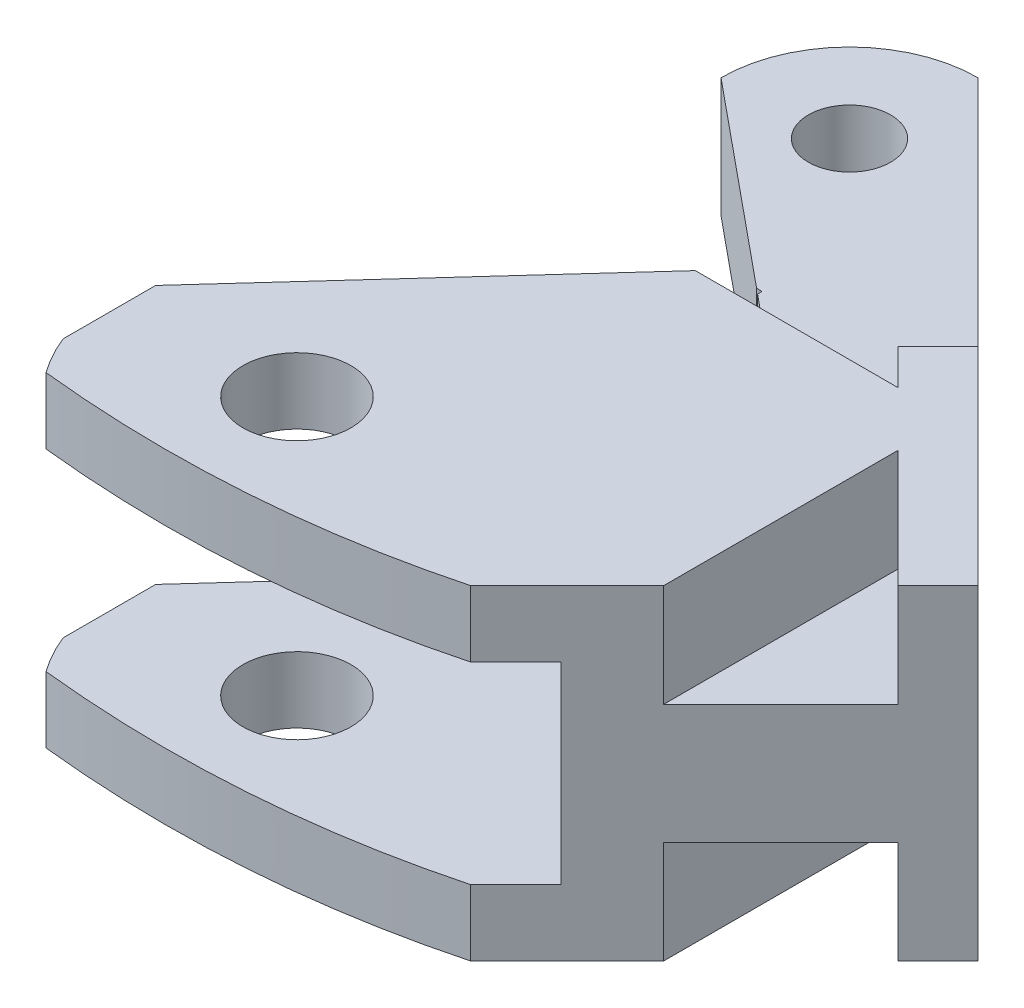
ISO-10303-21;
HEADER;
FILE_DESCRIPTION(('STEP AP214'),'2;1');
FILE_NAME('part.step','',(''),(''),'','','');
FILE_SCHEMA(('AUTOMOTIVE_DESIGN { 1 0 10303 214 1 1 1 1 }'));
ENDSEC;
DATA;
#1=APPLICATION_CONTEXT('core data for automotive mechanical design processes');
#2=APPLICATION_PROTOCOL_DEFINITION('international standard','automotive_design',2000,#1);
#3=PRODUCT_CONTEXT('',#1,'mechanical');
#4=PRODUCT('Part','Part','',(#3));
#5=PRODUCT_RELATED_PRODUCT_CATEGORY('part','',(#4));
#6=PRODUCT_DEFINITION_FORMATION('','',#4);
#7=PRODUCT_DEFINITION_CONTEXT('part definition',#1,'design');
#8=PRODUCT_DEFINITION('design','',#6,#7);
#9=PRODUCT_DEFINITION_SHAPE('','',#8);
#10=(LENGTH_UNIT() NAMED_UNIT(*) SI_UNIT(.MILLI.,.METRE.));
#11=(NAMED_UNIT(*) PLANE_ANGLE_UNIT() SI_UNIT($,.RADIAN.));
#12=(NAMED_UNIT(*) SI_UNIT($,.STERADIAN.) SOLID_ANGLE_UNIT());
#13=UNCERTAINTY_MEASURE_WITH_UNIT(LENGTH_MEASURE(1.E-05),#10,'distance_accuracy_value','');
#14=(GEOMETRIC_REPRESENTATION_CONTEXT(3) GLOBAL_UNCERTAINTY_ASSIGNED_CONTEXT((#13)) GLOBAL_UNIT_ASSIGNED_CONTEXT((#10,
#11,#12)) REPRESENTATION_CONTEXT('',''));
#15=CARTESIAN_POINT('',(0.,0.,0.));
#16=DIRECTION('',(0.,0.,1.));
#17=DIRECTION('',(1.,0.,0.));
#18=AXIS2_PLACEMENT_3D('',#15,#16,#17);
#19=CARTESIAN_POINT('',(0.803925841014231,10.,32.068751549964));
#20=CARTESIAN_POINT('',(16.7114791856673,10.,33.7569104793647));
#21=CARTESIAN_POINT('',(29.6504173946082,10.,24.650417394608));
#22=B_SPLINE_CURVE_WITH_KNOTS('',2,(#19,#20,#21),.UNSPECIFIED.,.F.,.F.,(3,3),(0.,1.),.UNSPECIFIED.);
#23=DIRECTION('',(0.,-1.,0.));
#24=VECTOR('',#23,1.);
#25=SURFACE_OF_LINEAR_EXTRUSION('',#22,#24);
#26=CARTESIAN_POINT('',(0.803925841014231,-4.,32.068751549964));
#27=CARTESIAN_POINT('',(16.7114791856673,-4.,33.7569104793647));
#28=CARTESIAN_POINT('',(29.6504173946082,-4.,24.650417394608));
#29=B_SPLINE_CURVE_WITH_KNOTS('',2,(#26,#27,#28),.UNSPECIFIED.,.F.,.F.,(3,3),(0.,1.),.UNSPECIFIED.);
#30=CARTESIAN_POINT('',(0.803925841014231,-4.,32.068751549964));
#31=VERTEX_POINT('',#30);
#32=CARTESIAN_POINT('',(16.2429206218236,-4.,30.9868463555271));
#33=VERTEX_POINT('',#32);
#34=EDGE_CURVE('E609',#31,#33,#29,.T.);
#35=ORIENTED_EDGE('',*,*,#34,.T.);
#36=DIRECTION('',(0.,-1.,0.));
#37=VECTOR('',#36,1.);
#38=CARTESIAN_POINT('',(16.2429206188106,2.325,30.9868463585402));
#39=LINE('',#38,#37);
#40=CARTESIAN_POINT('',(16.2429206196596,-1.425,30.9868463576911));
#41=VERTEX_POINT('',#40);
#42=EDGE_CURVE('E11',#33,#41,#39,.F.);
#43=ORIENTED_EDGE('',*,*,#42,.T.);
#44=CARTESIAN_POINT('',(0.803925841014231,-1.425,32.068751549964));
#45=CARTESIAN_POINT('',(16.7114791856673,-1.425,33.7569104793647));
#46=CARTESIAN_POINT('',(29.6504173946082,-1.425,24.650417394608));
#47=B_SPLINE_CURVE_WITH_KNOTS('',2,(#44,#45,#46),.UNSPECIFIED.,.F.,.F.,(3,3),(0.,1.),.UNSPECIFIED.);
#48=CARTESIAN_POINT('',(0.803925841014231,-1.425,32.068751549964));
#49=VERTEX_POINT('',#48);
#50=EDGE_CURVE('E280',#49,#41,#47,.T.);
#51=ORIENTED_EDGE('',*,*,#50,.F.);
#52=DIRECTION('',(0.,-1.,0.));
#53=VECTOR('',#52,1.);
#54=CARTESIAN_POINT('',(0.803925841014231,10.,32.068751549964));
#55=LINE('',#54,#53);
#56=EDGE_CURVE('E608',#49,#31,#55,.T.);
#57=ORIENTED_EDGE('',*,*,#56,.T.);
#58=EDGE_LOOP('',(#35,#43,#51,#57));
#59=FACE_BOUND('',#58,.T.);
#60=ADVANCED_FACE('F35',(#59),#25,.F.);
#61=CARTESIAN_POINT('',(0.,8.65,16.));
#62=DIRECTION('',(0.,0.,1.));
#63=DIRECTION('',(1.,0.,0.));
#64=AXIS2_PLACEMENT_3D('',#61,#62,#63);
#65=PLANE('',#64);
#66=DIRECTION('',(0.,1.,0.));
#67=VECTOR('',#66,1.);
#68=CARTESIAN_POINT('',(17.8887301627794,8.65,16.));
#69=LINE('',#68,#67);
#70=CARTESIAN_POINT('',(17.8887301627794,4.65,16.));
#71=VERTEX_POINT('',#70);
#72=CARTESIAN_POINT('',(17.8887301627794,8.65,16.));
#73=VERTEX_POINT('',#72);
#74=EDGE_CURVE('E301',#71,#73,#69,.T.);
#75=ORIENTED_EDGE('',*,*,#74,.F.);
#76=DIRECTION('',(1.,0.,0.));
#77=VECTOR('',#76,1.);
#78=CARTESIAN_POINT('',(9.,4.65,16.));
#79=LINE('',#78,#77);
#80=CARTESIAN_POINT('',(13.3801696824776,4.65,16.));
#81=VERTEX_POINT('',#80);
#82=EDGE_CURVE('E387',#81,#71,#79,.T.);
#83=ORIENTED_EDGE('',*,*,#82,.F.);
#84=DIRECTION('',(0.,-1.,0.));
#85=VECTOR('',#84,1.);
#86=CARTESIAN_POINT('',(13.3801696824776,6.075,16.));
#87=LINE('',#86,#85);
#88=CARTESIAN_POINT('',(13.3801696824776,6.075,16.));
#89=VERTEX_POINT('',#88);
#90=EDGE_CURVE('E363',#89,#81,#87,.T.);
#91=ORIENTED_EDGE('',*,*,#90,.F.);
#92=DIRECTION('',(-1.,0.,0.));
#93=VECTOR('',#92,1.);
#94=CARTESIAN_POINT('',(0.,6.075,16.));
#95=LINE('',#94,#93);
#96=CARTESIAN_POINT('',(10.,6.075,16.));
#97=VERTEX_POINT('',#96);
#98=EDGE_CURVE('E431',#89,#97,#95,.T.);
#99=ORIENTED_EDGE('',*,*,#98,.T.);
#100=DIRECTION('',(0.,1.,0.));
#101=VECTOR('',#100,1.);
#102=CARTESIAN_POINT('',(10.,-4.35,16.));
#103=LINE('',#102,#101);
#104=CARTESIAN_POINT('',(10.,8.65,16.));
#105=VERTEX_POINT('',#104);
#106=EDGE_CURVE('E332',#97,#105,#103,.T.);
#107=ORIENTED_EDGE('',*,*,#106,.T.);
#108=DIRECTION('',(-1.,0.,0.));
#109=VECTOR('',#108,1.);
#110=CARTESIAN_POINT('',(0.,8.65,16.));
#111=LINE('',#110,#109);
#112=EDGE_CURVE('E481',#73,#105,#111,.T.);
#113=ORIENTED_EDGE('',*,*,#112,.F.);
#114=EDGE_LOOP('',(#75,#83,#91,#99,#107,#113));
#115=FACE_BOUND('',#114,.T.);
#116=ADVANCED_FACE('F510',(#115),#65,.F.);
#117=CARTESIAN_POINT('',(0.,-4.,16.));
#118=DIRECTION('',(0.,0.,1.));
#119=DIRECTION('',(1.,0.,0.));
#120=AXIS2_PLACEMENT_3D('',#117,#118,#119);
#121=PLANE('',#120);
#122=DIRECTION('',(0.,1.,0.));
#123=VECTOR('',#122,1.);
#124=CARTESIAN_POINT('',(17.8887301627794,-4.,16.));
#125=LINE('',#124,#123);
#126=CARTESIAN_POINT('',(17.8887301627794,-4.,16.));
#127=VERTEX_POINT('',#126);
#128=CARTESIAN_POINT('',(17.8887301627794,0.,16.));
#129=VERTEX_POINT('',#128);
#130=EDGE_CURVE('E309',#127,#129,#125,.T.);
#131=ORIENTED_EDGE('',*,*,#130,.F.);
#132=DIRECTION('',(1.,0.,0.));
#133=VECTOR('',#132,1.);
#134=CARTESIAN_POINT('',(0.,-4.,16.));
#135=LINE('',#134,#133);
#136=CARTESIAN_POINT('',(10.,-4.,16.));
#137=VERTEX_POINT('',#136);
#138=EDGE_CURVE('E475',#137,#127,#135,.T.);
#139=ORIENTED_EDGE('',*,*,#138,.F.);
#140=CARTESIAN_POINT('',(10.,-1.425,16.));
#141=VERTEX_POINT('',#140);
#142=EDGE_CURVE('E335',#137,#141,#103,.T.);
#143=ORIENTED_EDGE('',*,*,#142,.T.);
#144=DIRECTION('',(1.,0.,0.));
#145=VECTOR('',#144,1.);
#146=CARTESIAN_POINT('',(0.,-1.425,16.));
#147=LINE('',#146,#145);
#148=CARTESIAN_POINT('',(13.3801696824776,-1.425,16.));
#149=VERTEX_POINT('',#148);
#150=EDGE_CURVE('E434',#141,#149,#147,.T.);
#151=ORIENTED_EDGE('',*,*,#150,.T.);
#152=CARTESIAN_POINT('',(13.3801696824776,0.,16.));
#153=VERTEX_POINT('',#152);
#154=EDGE_CURVE('E360',#153,#149,#87,.T.);
#155=ORIENTED_EDGE('',*,*,#154,.F.);
#156=DIRECTION('',(1.,0.,0.));
#157=VECTOR('',#156,1.);
#158=CARTESIAN_POINT('',(9.,0.,16.));
#159=LINE('',#158,#157);
#160=EDGE_CURVE('E393',#153,#129,#159,.T.);
#161=ORIENTED_EDGE('',*,*,#160,.T.);
#162=EDGE_LOOP('',(#131,#139,#143,#151,#155,#161));
#163=FACE_BOUND('',#162,.T.);
#164=ADVANCED_FACE('F518',(#163),#121,.F.);
#165=CARTESIAN_POINT('',(20.,4.65,16.));
#166=DIRECTION('',(-1.,0.,0.));
#167=DIRECTION('',(0.,0.,1.));
#168=AXIS2_PLACEMENT_3D('',#165,#166,#167);
#169=PLANE('',#168);
#170=DIRECTION('',(0.,0.,-1.));
#171=VECTOR('',#170,1.);
#172=CARTESIAN_POINT('',(20.,0.,35.));
#173=LINE('',#172,#171);
#174=CARTESIAN_POINT('',(20.,0.,27.2297669773507));
#175=VERTEX_POINT('',#174);
#176=CARTESIAN_POINT('',(20.,0.,18.1112698372206));
#177=VERTEX_POINT('',#176);
#178=EDGE_CURVE('E39',#175,#177,#173,.T.);
#179=ORIENTED_EDGE('',*,*,#178,.F.);
#180=DIRECTION('',(0.,-1.,0.));
#181=VECTOR('',#180,1.);
#182=CARTESIAN_POINT('',(20.,4.65,27.2297669773507));
#183=LINE('',#182,#181);
#184=CARTESIAN_POINT('',(20.,-4.,27.2297669773507));
#185=VERTEX_POINT('',#184);
#186=EDGE_CURVE('E631',#175,#185,#183,.T.);
#187=ORIENTED_EDGE('',*,*,#186,.T.);
#188=DIRECTION('',(0.,0.,-1.));
#189=VECTOR('',#188,1.);
#190=CARTESIAN_POINT('',(20.,-4.,35.));
#191=LINE('',#190,#189);
#192=CARTESIAN_POINT('',(20.,-4.,18.1112698372206));
#193=VERTEX_POINT('',#192);
#194=EDGE_CURVE('E445',#185,#193,#191,.T.);
#195=ORIENTED_EDGE('',*,*,#194,.T.);
#196=DIRECTION('',(0.,-1.,0.));
#197=VECTOR('',#196,1.);
#198=CARTESIAN_POINT('',(20.,4.65,18.1112698372206));
#199=LINE('',#198,#197);
#200=EDGE_CURVE('E313',#177,#193,#199,.T.);
#201=ORIENTED_EDGE('',*,*,#200,.F.);
#202=EDGE_LOOP('',(#179,#187,#195,#201));
#203=FACE_BOUND('',#202,.T.);
#204=ADVANCED_FACE('F37',(#203),#169,.F.);
#205=DIRECTION('',(0.,0.,1.));
#206=VECTOR('',#205,1.);
#207=CARTESIAN_POINT('',(20.,8.65,16.));
#208=LINE('',#207,#206);
#209=CARTESIAN_POINT('',(20.,8.65,18.1112698372206));
#210=VERTEX_POINT('',#209);
#211=CARTESIAN_POINT('',(20.,8.65,27.2297669773507));
#212=VERTEX_POINT('',#211);
#213=EDGE_CURVE('E442',#210,#212,#208,.T.);
#214=ORIENTED_EDGE('',*,*,#213,.T.);
#215=DIRECTION('',(0.,-1.,0.));
#216=VECTOR('',#215,1.);
#217=CARTESIAN_POINT('',(20.,4.65,27.2297669773507));
#218=LINE('',#217,#216);
#219=CARTESIAN_POINT('',(20.,4.65,27.2297669773507));
#220=VERTEX_POINT('',#219);
#221=EDGE_CURVE('E613',#212,#220,#218,.T.);
#222=ORIENTED_EDGE('',*,*,#221,.T.);
#223=DIRECTION('',(0.,0.,-1.));
#224=VECTOR('',#223,1.);
#225=CARTESIAN_POINT('',(20.,4.65,35.));
#226=LINE('',#225,#224);
#227=CARTESIAN_POINT('',(20.,4.65,18.1112698372206));
#228=VERTEX_POINT('',#227);
#229=EDGE_CURVE('E373',#220,#228,#226,.T.);
#230=ORIENTED_EDGE('',*,*,#229,.T.);
#231=DIRECTION('',(0.,-1.,0.));
#232=VECTOR('',#231,1.);
#233=CARTESIAN_POINT('',(20.,4.65,18.1112698372206));
#234=LINE('',#233,#232);
#235=EDGE_CURVE('E304',#210,#228,#234,.T.);
#236=ORIENTED_EDGE('',*,*,#235,.F.);
#237=EDGE_LOOP('',(#214,#222,#230,#236));
#238=FACE_BOUND('',#237,.T.);
#239=ADVANCED_FACE('F660',(#238),#169,.F.);
#240=CARTESIAN_POINT('',(5.00000000000004,0.,5.00000000000004));
#241=DIRECTION('',(0.,1.,0.));
#242=DIRECTION('',(0.,0.,1.));
#243=AXIS2_PLACEMENT_3D('',#240,#241,#242);
#244=PLANE('',#243);
#245=DIRECTION('',(-0.707106781186551,0.,-0.707106781186544));
#246=VECTOR('',#245,1.);
#247=CARTESIAN_POINT('',(5.94436508138966,0.,4.05563491861041));
#248=LINE('',#247,#246);
#249=CARTESIAN_POINT('',(24.5592485700651,0.,22.6705184072856));
#250=VERTEX_POINT('',#249);
#251=EDGE_CURVE('E310',#250,#177,#248,.T.);
#252=ORIENTED_EDGE('',*,*,#251,.F.);
#253=DIRECTION('',(-0.707106781186544,0.,0.707106781186551));
#254=VECTOR('',#253,1.);
#255=CARTESIAN_POINT('',(23.6148834886754,0.,23.6148834886753));
#256=LINE('',#255,#254);
#257=EDGE_CURVE('E634',#250,#175,#256,.T.);
#258=ORIENTED_EDGE('',*,*,#257,.T.);
#259=ORIENTED_EDGE('',*,*,#178,.T.);
#260=EDGE_LOOP('',(#252,#258,#259));
#261=FACE_BOUND('',#260,.T.);
#262=ADVANCED_FACE('F657',(#261),#244,.F.);
#263=CARTESIAN_POINT('',(5.00000000000004,4.65,5.00000000000004));
#264=DIRECTION('',(0.,1.,0.));
#265=DIRECTION('',(0.,0.,1.));
#266=AXIS2_PLACEMENT_3D('',#263,#264,#265);
#267=PLANE('',#266);
#268=DIRECTION('',(-0.707106781186544,0.,0.707106781186551));
#269=VECTOR('',#268,1.);
#270=CARTESIAN_POINT('',(23.6148834886754,4.65,23.6148834886753));
#271=LINE('',#270,#269);
#272=CARTESIAN_POINT('',(24.5592485700651,4.65,22.6705184072856));
#273=VERTEX_POINT('',#272);
#274=EDGE_CURVE('E626',#273,#220,#271,.T.);
#275=ORIENTED_EDGE('',*,*,#274,.F.);
#276=DIRECTION('',(-0.707106781186551,0.,-0.707106781186544));
#277=VECTOR('',#276,1.);
#278=CARTESIAN_POINT('',(5.94436508138966,4.65,4.05563491861041));
#279=LINE('',#278,#277);
#280=EDGE_CURVE('E302',#273,#228,#279,.T.);
#281=ORIENTED_EDGE('',*,*,#280,.T.);
#282=ORIENTED_EDGE('',*,*,#229,.F.);
#283=EDGE_LOOP('',(#275,#281,#282));
#284=FACE_BOUND('',#283,.T.);
#285=ADVANCED_FACE('F659',(#284),#267,.T.);
#286=CARTESIAN_POINT('',(9.,6.075,19.));
#287=DIRECTION('',(0.,0.,-1.));
#288=DIRECTION('',(-1.,0.,0.));
#289=AXIS2_PLACEMENT_3D('',#286,#287,#288);
#290=PLANE('',#289);
#291=DIRECTION('',(0.,-1.,0.));
#292=VECTOR('',#291,1.);
#293=CARTESIAN_POINT('',(13.3801696824776,6.075,19.));
#294=LINE('',#293,#292);
#295=CARTESIAN_POINT('',(13.3801696824776,6.075,19.));
#296=VERTEX_POINT('',#295);
#297=CARTESIAN_POINT('',(13.3801696824776,-1.425,19.));
#298=VERTEX_POINT('',#297);
#299=EDGE_CURVE('E366',#296,#298,#294,.T.);
#300=ORIENTED_EDGE('',*,*,#299,.T.);
#301=DIRECTION('',(-1.,0.,0.));
#302=VECTOR('',#301,1.);
#303=CARTESIAN_POINT('',(9.,-1.425,19.));
#304=LINE('',#303,#302);
#305=CARTESIAN_POINT('',(18.,-1.425,19.));
#306=VERTEX_POINT('',#305);
#307=EDGE_CURVE('E468',#306,#298,#304,.T.);
#308=ORIENTED_EDGE('',*,*,#307,.F.);
#309=DIRECTION('',(0.,-1.,0.));
#310=VECTOR('',#309,1.);
#311=CARTESIAN_POINT('',(18.,6.075,19.));
#312=LINE('',#311,#310);
#313=CARTESIAN_POINT('',(18.,6.075,19.));
#314=VERTEX_POINT('',#313);
#315=EDGE_CURVE('E449',#314,#306,#312,.T.);
#316=ORIENTED_EDGE('',*,*,#315,.F.);
#317=DIRECTION('',(-1.,0.,0.));
#318=VECTOR('',#317,1.);
#319=CARTESIAN_POINT('',(9.,6.075,19.));
#320=LINE('',#319,#318);
#321=EDGE_CURVE('E467',#314,#296,#320,.T.);
#322=ORIENTED_EDGE('',*,*,#321,.T.);
#323=EDGE_LOOP('',(#300,#308,#316,#322));
#324=FACE_BOUND('',#323,.T.);
#325=ADVANCED_FACE('F666',(#324),#290,.F.);
#326=CARTESIAN_POINT('',(8.,0.,0.));
#327=DIRECTION('',(-1.,0.,0.));
#328=DIRECTION('',(0.,0.,1.));
#329=AXIS2_PLACEMENT_3D('',#326,#327,#328);
#330=PLANE('',#329);
#331=DIRECTION('',(0.,-1.,0.));
#332=VECTOR('',#331,1.);
#333=CARTESIAN_POINT('',(8.,0.,11.5768971611207));
#334=LINE('',#333,#332);
#335=CARTESIAN_POINT('',(8.,4.65,11.5768971611207));
#336=VERTEX_POINT('',#335);
#337=CARTESIAN_POINT('',(8.,0.,11.5768971611207));
#338=VERTEX_POINT('',#337);
#339=EDGE_CURVE('E354',#336,#338,#334,.T.);
#340=ORIENTED_EDGE('',*,*,#339,.F.);
#341=DIRECTION('',(0.,0.,1.));
#342=VECTOR('',#341,1.);
#343=CARTESIAN_POINT('',(8.,4.65,5.00000000000004));
#344=LINE('',#343,#342);
#345=CARTESIAN_POINT('',(8.,4.65,11.4033929776909));
#346=VERTEX_POINT('',#345);
#347=EDGE_CURVE('E426',#346,#336,#344,.T.);
#348=ORIENTED_EDGE('',*,*,#347,.F.);
#349=DIRECTION('',(0.,-1.,0.));
#350=VECTOR('',#349,1.);
#351=CARTESIAN_POINT('',(8.,-1.425,11.4033929776909));
#352=LINE('',#351,#350);
#353=CARTESIAN_POINT('',(8.,0.,11.4033929776909));
#354=VERTEX_POINT('',#353);
#355=EDGE_CURVE('E417',#346,#354,#352,.T.);
#356=ORIENTED_EDGE('',*,*,#355,.T.);
#357=DIRECTION('',(0.,0.,1.));
#358=VECTOR('',#357,1.);
#359=CARTESIAN_POINT('',(8.,0.,5.00000000000004));
#360=LINE('',#359,#358);
#361=EDGE_CURVE('E421',#354,#338,#360,.T.);
#362=ORIENTED_EDGE('',*,*,#361,.T.);
#363=EDGE_LOOP('',(#340,#348,#356,#362));
#364=FACE_BOUND('',#363,.T.);
#365=ADVANCED_FACE('F675',(#364),#330,.T.);
#366=CARTESIAN_POINT('',(0.,4.65,27.));
#367=DIRECTION('',(1.,0.,0.));
#368=DIRECTION('',(0.,0.,-1.));
#369=AXIS2_PLACEMENT_3D('',#366,#367,#368);
#370=PLANE('',#369);
#371=DIRECTION('',(0.,0.,-1.));
#372=VECTOR('',#371,1.);
#373=CARTESIAN_POINT('',(0.,-4.,35.));
#374=LINE('',#373,#372);
#375=CARTESIAN_POINT('',(0.,-4.,30.5980762113533));
#376=VERTEX_POINT('',#375);
#377=CARTESIAN_POINT('',(0.,-4.,27.));
#378=VERTEX_POINT('',#377);
#379=EDGE_CURVE('E471',#376,#378,#374,.T.);
#380=ORIENTED_EDGE('',*,*,#379,.F.);
#381=DIRECTION('',(0.,1.,0.));
#382=VECTOR('',#381,1.);
#383=CARTESIAN_POINT('',(0.,-4.35,30.5980762113533));
#384=LINE('',#383,#382);
#385=CARTESIAN_POINT('',(0.,-1.425,30.5980762113533));
#386=VERTEX_POINT('',#385);
#387=EDGE_CURVE('E321',#376,#386,#384,.T.);
#388=ORIENTED_EDGE('',*,*,#387,.T.);
#389=DIRECTION('',(0.,0.,1.));
#390=VECTOR('',#389,1.);
#391=CARTESIAN_POINT('',(0.,-1.425,35.));
#392=LINE('',#391,#390);
#393=CARTESIAN_POINT('',(0.,-1.425,27.));
#394=VERTEX_POINT('',#393);
#395=EDGE_CURVE('E464',#394,#386,#392,.T.);
#396=ORIENTED_EDGE('',*,*,#395,.F.);
#397=DIRECTION('',(0.,1.,0.));
#398=VECTOR('',#397,1.);
#399=CARTESIAN_POINT('',(0.,-4.35,27.));
#400=LINE('',#399,#398);
#401=EDGE_CURVE('E336',#378,#394,#400,.T.);
#402=ORIENTED_EDGE('',*,*,#401,.F.);
#403=EDGE_LOOP('',(#380,#388,#396,#402));
#404=FACE_BOUND('',#403,.T.);
#405=ADVANCED_FACE('F506',(#404),#370,.F.);
#406=CARTESIAN_POINT('',(4.55,0.,4.55));
#407=DIRECTION('',(0.,1.,0.));
#408=DIRECTION('',(0.,0.,1.));
#409=AXIS2_PLACEMENT_3D('',#406,#407,#408);
#410=CIRCLE('',#409,1.6);
#411=CARTESIAN_POINT('',(4.55,0.,6.15));
#412=VERTEX_POINT('',#411);
#413=EDGE_CURVE('E483',#412,#412,#410,.T.);
#414=ORIENTED_EDGE('',*,*,#413,.T.);
#415=EDGE_LOOP('',(#414));
#416=FACE_BOUND('',#415,.T.);
#417=DIRECTION('',(0.707106781186551,0.,0.707106781186544));
#418=VECTOR('',#417,1.);
#419=CARTESIAN_POINT('',(31.0646309569813,0.,26.064630956981));
#420=LINE('',#419,#418);
#421=CARTESIAN_POINT('',(5.00000000000004,0.,0.));
#422=VERTEX_POINT('',#421);
#423=CARTESIAN_POINT('',(18.0563491861041,0.,13.0563491861039));
#424=VERTEX_POINT('',#423);
#425=EDGE_CURVE('E375',#422,#424,#420,.T.);
#426=ORIENTED_EDGE('',*,*,#425,.T.);
#427=DIRECTION('',(-0.707106781186544,0.,0.707106781186551));
#428=VECTOR('',#427,1.);
#429=CARTESIAN_POINT('',(15.5563491861041,0.,15.556349186104));
#430=LINE('',#429,#428);
#431=CARTESIAN_POINT('',(16.5007142674937,0.,14.6119841047144));
#432=VERTEX_POINT('',#431);
#433=EDGE_CURVE('E61',#424,#432,#430,.T.);
#434=ORIENTED_EDGE('',*,*,#433,.T.);
#435=EDGE_CURVE('E307',#129,#432,#248,.T.);
#436=ORIENTED_EDGE('',*,*,#435,.F.);
#437=ORIENTED_EDGE('',*,*,#160,.F.);
#438=DIRECTION('',(0.772467198086561,0.,0.635054665269296));
#439=VECTOR('',#438,1.);
#440=CARTESIAN_POINT('',(13.3801696824776,0.,16.));
#441=LINE('',#440,#439);
#442=EDGE_CURVE('E344',#338,#153,#441,.T.);
#443=ORIENTED_EDGE('',*,*,#442,.F.);
#444=ORIENTED_EDGE('',*,*,#361,.F.);
#445=DIRECTION('',(-1.,0.,0.));
#446=VECTOR('',#445,1.);
#447=CARTESIAN_POINT('',(5.00000000000004,0.,11.4033929776909));
#448=LINE('',#447,#446);
#449=CARTESIAN_POINT('',(7.78895314409903,0.,11.4033929776909));
#450=VERTEX_POINT('',#449);
#451=EDGE_CURVE('E439',#354,#450,#448,.T.);
#452=ORIENTED_EDGE('',*,*,#451,.T.);
#453=CARTESIAN_POINT('',(0.,0.,5.));
#454=VERTEX_POINT('',#453);
#455=EDGE_CURVE('E350',#454,#450,#441,.T.);
#456=ORIENTED_EDGE('',*,*,#455,.F.);
#457=CARTESIAN_POINT('',(5.00000000000004,0.,5.00000000000004));
#458=DIRECTION('',(0.,1.,0.));
#459=DIRECTION('',(0.,0.,1.));
#460=AXIS2_PLACEMENT_3D('',#457,#458,#459);
#461=CIRCLE('',#460,5.00000000000004);
#462=EDGE_CURVE('E400',#422,#454,#461,.T.);
#463=ORIENTED_EDGE('',*,*,#462,.F.);
#464=EDGE_LOOP('',(#426,#434,#436,#437,#443,#444,#452,#456,#463));
#465=FACE_BOUND('',#464,.T.);
#466=ADVANCED_FACE('F488',(#416,#465),#244,.F.);
#467=DIRECTION('',(-0.707106781186544,0.,0.707106781186551));
#468=VECTOR('',#467,1.);
#469=CARTESIAN_POINT('',(15.5563491861041,4.65,15.556349186104));
#470=LINE('',#469,#468);
#471=CARTESIAN_POINT('',(18.0563491861041,4.65,13.056349186104));
#472=VERTEX_POINT('',#471);
#473=CARTESIAN_POINT('',(16.5007142674937,4.65,14.6119841047144));
#474=VERTEX_POINT('',#473);
#475=EDGE_CURVE('E294',#472,#474,#470,.T.);
#476=ORIENTED_EDGE('',*,*,#475,.F.);
#477=DIRECTION('',(0.707106781186551,0.,0.707106781186544));
#478=VECTOR('',#477,1.);
#479=CARTESIAN_POINT('',(31.0646309569813,4.65,26.064630956981));
#480=LINE('',#479,#478);
#481=CARTESIAN_POINT('',(5.00000000000004,4.65,0.));
#482=VERTEX_POINT('',#481);
#483=EDGE_CURVE('E374',#482,#472,#480,.T.);
#484=ORIENTED_EDGE('',*,*,#483,.F.);
#485=CARTESIAN_POINT('',(5.00000000000004,4.65,5.00000000000004));
#486=DIRECTION('',(0.,1.,0.));
#487=DIRECTION('',(0.,0.,1.));
#488=AXIS2_PLACEMENT_3D('',#485,#486,#487);
#489=CIRCLE('',#488,5.00000000000004);
#490=CARTESIAN_POINT('',(0.,4.65,5.00000000000004));
#491=VERTEX_POINT('',#490);
#492=EDGE_CURVE('E392',#482,#491,#489,.T.);
#493=ORIENTED_EDGE('',*,*,#492,.T.);
#494=DIRECTION('',(0.772467198086561,0.,0.635054665269296));
#495=VECTOR('',#494,1.);
#496=CARTESIAN_POINT('',(13.3801696824776,4.65,16.));
#497=LINE('',#496,#495);
#498=CARTESIAN_POINT('',(7.78895314409903,4.65,11.4033929776909));
#499=VERTEX_POINT('',#498);
#500=EDGE_CURVE('E345',#491,#499,#497,.T.);
#501=ORIENTED_EDGE('',*,*,#500,.T.);
#502=DIRECTION('',(-1.,0.,0.));
#503=VECTOR('',#502,1.);
#504=CARTESIAN_POINT('',(5.00000000000004,4.65,11.4033929776909));
#505=LINE('',#504,#503);
#506=EDGE_CURVE('E436',#346,#499,#505,.T.);
#507=ORIENTED_EDGE('',*,*,#506,.F.);
#508=ORIENTED_EDGE('',*,*,#347,.T.);
#509=EDGE_CURVE('E349',#336,#81,#497,.T.);
#510=ORIENTED_EDGE('',*,*,#509,.T.);
#511=ORIENTED_EDGE('',*,*,#82,.T.);
#512=EDGE_CURVE('E298',#71,#474,#279,.T.);
#513=ORIENTED_EDGE('',*,*,#512,.T.);
#514=EDGE_LOOP('',(#476,#484,#493,#501,#507,#508,#510,#511,#513));
#515=FACE_BOUND('',#514,.T.);
#516=CARTESIAN_POINT('',(4.55,4.65,4.55));
#517=DIRECTION('',(0.,1.,0.));
#518=DIRECTION('',(0.,0.,1.));
#519=AXIS2_PLACEMENT_3D('',#516,#517,#518);
#520=CIRCLE('',#519,1.6);
#521=CARTESIAN_POINT('',(4.55,4.65,6.15));
#522=VERTEX_POINT('',#521);
#523=EDGE_CURVE('E402',#522,#522,#520,.T.);
#524=ORIENTED_EDGE('',*,*,#523,.F.);
#525=EDGE_LOOP('',(#524));
#526=FACE_BOUND('',#525,.T.);
#527=ADVANCED_FACE('F582',(#515,#526),#267,.T.);
#528=CARTESIAN_POINT('',(5.00000000000004,4.65,5.00000000000004));
#529=DIRECTION('',(0.,-1.,0.));
#530=DIRECTION('',(0.,0.,-1.));
#531=AXIS2_PLACEMENT_3D('',#528,#529,#530);
#532=CYLINDRICAL_SURFACE('',#531,5.00000000000004);
#533=ORIENTED_EDGE('',*,*,#462,.T.);
#534=DIRECTION('',(0.,-1.,0.));
#535=VECTOR('',#534,1.);
#536=CARTESIAN_POINT('',(0.,4.65,5.00000000000004));
#537=LINE('',#536,#535);
#538=EDGE_CURVE('E391',#491,#454,#537,.T.);
#539=ORIENTED_EDGE('',*,*,#538,.F.);
#540=ORIENTED_EDGE('',*,*,#492,.F.);
#541=DIRECTION('',(0.,-1.,0.));
#542=VECTOR('',#541,1.);
#543=CARTESIAN_POINT('',(5.00000000000004,4.65,0.));
#544=LINE('',#543,#542);
#545=EDGE_CURVE('E386',#482,#422,#544,.T.);
#546=ORIENTED_EDGE('',*,*,#545,.T.);
#547=EDGE_LOOP('',(#533,#539,#540,#546));
#548=FACE_BOUND('',#547,.T.);
#549=ADVANCED_FACE('F503',(#548),#532,.T.);
#550=DIRECTION('',(0.,0.,-1.));
#551=VECTOR('',#550,1.);
#552=CARTESIAN_POINT('',(0.,6.075,35.));
#553=LINE('',#552,#551);
#554=CARTESIAN_POINT('',(0.,6.075,30.5980762113533));
#555=VERTEX_POINT('',#554);
#556=CARTESIAN_POINT('',(0.,6.075,27.));
#557=VERTEX_POINT('',#556);
#558=EDGE_CURVE('E462',#555,#557,#553,.T.);
#559=ORIENTED_EDGE('',*,*,#558,.F.);
#560=CARTESIAN_POINT('',(0.,8.65,30.5980762113533));
#561=VERTEX_POINT('',#560);
#562=EDGE_CURVE('E318',#555,#561,#384,.T.);
#563=ORIENTED_EDGE('',*,*,#562,.T.);
#564=DIRECTION('',(0.,0.,1.));
#565=VECTOR('',#564,1.);
#566=CARTESIAN_POINT('',(0.,8.65,35.));
#567=LINE('',#566,#565);
#568=CARTESIAN_POINT('',(0.,8.65,27.));
#569=VERTEX_POINT('',#568);
#570=EDGE_CURVE('E478',#569,#561,#567,.T.);
#571=ORIENTED_EDGE('',*,*,#570,.F.);
#572=EDGE_CURVE('E331',#557,#569,#400,.T.);
#573=ORIENTED_EDGE('',*,*,#572,.F.);
#574=EDGE_LOOP('',(#559,#563,#571,#573));
#575=FACE_BOUND('',#574,.T.);
#576=ADVANCED_FACE('F493',(#575),#370,.F.);
#577=CARTESIAN_POINT('',(4.55,4.65,4.55));
#578=DIRECTION('',(0.,-1.,0.));
#579=DIRECTION('',(0.,0.,-1.));
#580=AXIS2_PLACEMENT_3D('',#577,#578,#579);
#581=CYLINDRICAL_SURFACE('',#580,1.6);
#582=ORIENTED_EDGE('',*,*,#523,.T.);
#583=EDGE_LOOP('',(#582));
#584=FACE_BOUND('',#583,.T.);
#585=ORIENTED_EDGE('',*,*,#413,.F.);
#586=EDGE_LOOP('',(#585));
#587=FACE_BOUND('',#586,.T.);
#588=ADVANCED_FACE('F490',(#584,#587),#581,.F.);
#589=CARTESIAN_POINT('',(0.,8.65,0.));
#590=DIRECTION('',(0.,-1.,0.));
#591=DIRECTION('',(0.,0.,-1.));
#592=AXIS2_PLACEMENT_3D('',#589,#590,#591);
#593=PLANE('',#592);
#594=CARTESIAN_POINT('',(0.803925841014231,8.65,32.068751549964));
#595=CARTESIAN_POINT('',(16.7114791856673,8.65,33.7569104793647));
#596=CARTESIAN_POINT('',(29.6504173946082,8.65,24.650417394608));
#597=B_SPLINE_CURVE_WITH_KNOTS('',2,(#594,#595,#596),.UNSPECIFIED.,.F.,.F.,(3,3),(0.,1.),.UNSPECIFIED.);
#598=CARTESIAN_POINT('',(0.803925841014231,8.65,32.068751549964));
#599=VERTEX_POINT('',#598);
#600=CARTESIAN_POINT('',(16.2429206188099,8.65,30.9868463585404));
#601=VERTEX_POINT('',#600);
#602=EDGE_CURVE('E543',#599,#601,#597,.T.);
#603=ORIENTED_EDGE('',*,*,#602,.T.);
#604=DIRECTION('',(0.707106781186544,0.,-0.707106781186551));
#605=VECTOR('',#604,1.);
#606=CARTESIAN_POINT('',(11.9727478649446,8.65,35.2570191124062));
#607=LINE('',#606,#605);
#608=EDGE_CURVE('E53',#601,#212,#607,.T.);
#609=ORIENTED_EDGE('',*,*,#608,.T.);
#610=ORIENTED_EDGE('',*,*,#213,.F.);
#611=DIRECTION('',(0.707106781186551,0.,0.707106781186544));
#612=VECTOR('',#611,1.);
#613=CARTESIAN_POINT('',(29.5089960383709,8.65,27.6202658755915));
#614=LINE('',#613,#612);
#615=CARTESIAN_POINT('',(24.5592485700651,8.65,22.6705184072856));
#616=VERTEX_POINT('',#615);
#617=EDGE_CURVE('E564',#210,#616,#614,.T.);
#618=ORIENTED_EDGE('',*,*,#617,.T.);
#619=CARTESIAN_POINT('',(26.1148834886755,8.65,21.1148834886752));
#620=VERTEX_POINT('',#619);
#621=EDGE_CURVE('E646',#616,#620,#607,.T.);
#622=ORIENTED_EDGE('',*,*,#621,.T.);
#623=DIRECTION('',(0.707106781186551,0.,0.707106781186544));
#624=VECTOR('',#623,1.);
#625=CARTESIAN_POINT('',(31.0646309569813,8.65,26.064630956981));
#626=LINE('',#625,#624);
#627=CARTESIAN_POINT('',(18.0563491861041,8.65,13.056349186104));
#628=VERTEX_POINT('',#627);
#629=EDGE_CURVE('E271',#628,#620,#626,.T.);
#630=ORIENTED_EDGE('',*,*,#629,.F.);
#631=DIRECTION('',(0.707106781186544,0.,-0.707106781186551));
#632=VECTOR('',#631,1.);
#633=CARTESIAN_POINT('',(16.5007142674937,8.65,14.6119841047144));
#634=LINE('',#633,#632);
#635=CARTESIAN_POINT('',(16.5007142674937,8.65,14.6119841047144));
#636=VERTEX_POINT('',#635);
#637=EDGE_CURVE('E291',#636,#628,#634,.T.);
#638=ORIENTED_EDGE('',*,*,#637,.F.);
#639=EDGE_CURVE('E288',#636,#73,#614,.T.);
#640=ORIENTED_EDGE('',*,*,#639,.T.);
#641=ORIENTED_EDGE('',*,*,#112,.T.);
#642=DIRECTION('',(0.672672793996313,0.,-0.739940073395944));
#643=VECTOR('',#642,1.);
#644=CARTESIAN_POINT('',(10.,8.65,16.));
#645=LINE('',#644,#643);
#646=EDGE_CURVE('E328',#569,#105,#645,.T.);
#647=ORIENTED_EDGE('',*,*,#646,.F.);
#648=ORIENTED_EDGE('',*,*,#570,.T.);
#649=CARTESIAN_POINT('',(6.5,8.65,28.));
#650=DIRECTION('',(0.,-1.,0.));
#651=DIRECTION('',(0.,0.,1.));
#652=AXIS2_PLACEMENT_3D('',#649,#650,#651);
#653=CIRCLE('',#652,7.);
#654=EDGE_CURVE('E316',#599,#561,#653,.T.);
#655=ORIENTED_EDGE('',*,*,#654,.F.);
#656=EDGE_LOOP('',(#603,#609,#610,#618,#622,#630,#638,#640,#641,#647,#648,#655));
#657=FACE_BOUND('',#656,.T.);
#658=CARTESIAN_POINT('',(6.5,8.65,28.));
#659=DIRECTION('',(0.,1.,0.));
#660=DIRECTION('',(0.,0.,1.));
#661=AXIS2_PLACEMENT_3D('',#658,#659,#660);
#662=CIRCLE('',#661,2.1);
#663=CARTESIAN_POINT('',(6.5,8.65,30.1));
#664=VERTEX_POINT('',#663);
#665=EDGE_CURVE('E412',#664,#664,#662,.T.);
#666=ORIENTED_EDGE('',*,*,#665,.F.);
#667=EDGE_LOOP('',(#666));
#668=FACE_BOUND('',#667,.T.);
#669=ADVANCED_FACE('F492',(#657,#668),#593,.F.);
#670=CARTESIAN_POINT('',(0.,-4.,0.));
#671=DIRECTION('',(0.,-1.,0.));
#672=DIRECTION('',(0.,0.,-1.));
#673=AXIS2_PLACEMENT_3D('',#670,#671,#672);
#674=PLANE('',#673);
#675=DIRECTION('',(0.707106781186544,0.,-0.707106781186551));
#676=VECTOR('',#675,1.);
#677=CARTESIAN_POINT('',(11.9727478649446,-4.,35.2570191124062));
#678=LINE('',#677,#676);
#679=EDGE_CURVE('E262',#33,#185,#678,.T.);
#680=ORIENTED_EDGE('',*,*,#679,.F.);
#681=ORIENTED_EDGE('',*,*,#34,.F.);
#682=CARTESIAN_POINT('',(6.5,-4.,28.));
#683=DIRECTION('',(0.,-1.,0.));
#684=DIRECTION('',(0.,0.,-1.));
#685=AXIS2_PLACEMENT_3D('',#682,#683,#684);
#686=CIRCLE('',#685,7.);
#687=EDGE_CURVE('E325',#376,#31,#686,.F.);
#688=ORIENTED_EDGE('',*,*,#687,.F.);
#689=ORIENTED_EDGE('',*,*,#379,.T.);
#690=DIRECTION('',(-0.672672793996313,0.,0.739940073395944));
#691=VECTOR('',#690,1.);
#692=CARTESIAN_POINT('',(13.4389140271493,-4.,12.2171945701358));
#693=LINE('',#692,#691);
#694=EDGE_CURVE('E341',#137,#378,#693,.T.);
#695=ORIENTED_EDGE('',*,*,#694,.F.);
#696=ORIENTED_EDGE('',*,*,#138,.T.);
#697=DIRECTION('',(-0.707106781186551,0.,-0.707106781186544));
#698=VECTOR('',#697,1.);
#699=CARTESIAN_POINT('',(29.5089960383709,-4.,27.6202658755915));
#700=LINE('',#699,#698);
#701=CARTESIAN_POINT('',(16.5007142674937,-4.,14.6119841047144));
#702=VERTEX_POINT('',#701);
#703=EDGE_CURVE('E381',#127,#702,#700,.T.);
#704=ORIENTED_EDGE('',*,*,#703,.T.);
#705=DIRECTION('',(0.707106781186544,0.,-0.707106781186551));
#706=VECTOR('',#705,1.);
#707=CARTESIAN_POINT('',(16.5007142674937,-4.,14.6119841047144));
#708=LINE('',#707,#706);
#709=CARTESIAN_POINT('',(18.0563491861041,-4.,13.056349186104));
#710=VERTEX_POINT('',#709);
#711=EDGE_CURVE('E277',#702,#710,#708,.T.);
#712=ORIENTED_EDGE('',*,*,#711,.T.);
#713=DIRECTION('',(-0.707106781186551,0.,-0.707106781186544));
#714=VECTOR('',#713,1.);
#715=CARTESIAN_POINT('',(31.0646309569813,-4.,26.064630956981));
#716=LINE('',#715,#714);
#717=CARTESIAN_POINT('',(26.1148834886755,-4.,21.1148834886752));
#718=VERTEX_POINT('',#717);
#719=EDGE_CURVE('E268',#718,#710,#716,.T.);
#720=ORIENTED_EDGE('',*,*,#719,.F.);
#721=CARTESIAN_POINT('',(24.5592485700651,-4.,22.6705184072856));
#722=VERTEX_POINT('',#721);
#723=EDGE_CURVE('E251',#722,#718,#678,.T.);
#724=ORIENTED_EDGE('',*,*,#723,.F.);
#725=EDGE_CURVE('E557',#722,#193,#700,.T.);
#726=ORIENTED_EDGE('',*,*,#725,.T.);
#727=ORIENTED_EDGE('',*,*,#194,.F.);
#728=EDGE_LOOP('',(#680,#681,#688,#689,#695,#696,#704,#712,#720,#724,#726,#727));
#729=FACE_BOUND('',#728,.T.);
#730=CARTESIAN_POINT('',(6.5,-4.,28.));
#731=DIRECTION('',(0.,-1.,0.));
#732=DIRECTION('',(0.,0.,-1.));
#733=AXIS2_PLACEMENT_3D('',#730,#731,#732);
#734=CIRCLE('',#733,2.1);
#735=CARTESIAN_POINT('',(6.5,-4.,25.9));
#736=VERTEX_POINT('',#735);
#737=EDGE_CURVE('E459',#736,#736,#734,.T.);
#738=ORIENTED_EDGE('',*,*,#737,.F.);
#739=EDGE_LOOP('',(#738));
#740=FACE_BOUND('',#739,.T.);
#741=ADVANCED_FACE('F274',(#729,#740),#674,.T.);
#742=CARTESIAN_POINT('',(9.,-1.425,35.));
#743=DIRECTION('',(0.,-1.,0.));
#744=DIRECTION('',(0.,0.,-1.));
#745=AXIS2_PLACEMENT_3D('',#742,#743,#744);
#746=PLANE('',#745);
#747=ORIENTED_EDGE('',*,*,#50,.T.);
#748=DIRECTION('',(0.707106781186544,0.,-0.707106781186551));
#749=VECTOR('',#748,1.);
#750=CARTESIAN_POINT('',(10.6148834886754,-1.425,36.6148834886754));
#751=LINE('',#750,#749);
#752=CARTESIAN_POINT('',(18.,-1.425,29.2297669773508));
#753=VERTEX_POINT('',#752);
#754=EDGE_CURVE('E638',#41,#753,#751,.T.);
#755=ORIENTED_EDGE('',*,*,#754,.T.);
#756=DIRECTION('',(0.,0.,1.));
#757=VECTOR('',#756,1.);
#758=CARTESIAN_POINT('',(18.,-1.425,19.));
#759=LINE('',#758,#757);
#760=EDGE_CURVE('E452',#306,#753,#759,.T.);
#761=ORIENTED_EDGE('',*,*,#760,.F.);
#762=ORIENTED_EDGE('',*,*,#307,.T.);
#763=DIRECTION('',(0.,0.,-1.));
#764=VECTOR('',#763,1.);
#765=CARTESIAN_POINT('',(13.3801696824776,-1.425,16.));
#766=LINE('',#765,#764);
#767=EDGE_CURVE('E356',#298,#149,#766,.T.);
#768=ORIENTED_EDGE('',*,*,#767,.T.);
#769=ORIENTED_EDGE('',*,*,#150,.F.);
#770=DIRECTION('',(-0.672672793996313,0.,0.739940073395944));
#771=VECTOR('',#770,1.);
#772=CARTESIAN_POINT('',(0.0904977375565611,-1.425,26.9004524886878));
#773=LINE('',#772,#771);
#774=EDGE_CURVE('E338',#141,#394,#773,.T.);
#775=ORIENTED_EDGE('',*,*,#774,.T.);
#776=ORIENTED_EDGE('',*,*,#395,.T.);
#777=CARTESIAN_POINT('',(6.5,-1.425,28.));
#778=DIRECTION('',(0.,-1.,0.));
#779=DIRECTION('',(0.,0.,-1.));
#780=AXIS2_PLACEMENT_3D('',#777,#778,#779);
#781=CIRCLE('',#780,7.);
#782=EDGE_CURVE('E322',#386,#49,#781,.F.);
#783=ORIENTED_EDGE('',*,*,#782,.T.);
#784=EDGE_LOOP('',(#747,#755,#761,#762,#768,#769,#775,#776,#783));
#785=FACE_BOUND('',#784,.T.);
#786=CARTESIAN_POINT('',(6.5,-1.425,28.));
#787=DIRECTION('',(0.,-1.,0.));
#788=DIRECTION('',(0.,0.,-1.));
#789=AXIS2_PLACEMENT_3D('',#786,#787,#788);
#790=CIRCLE('',#789,2.1);
#791=CARTESIAN_POINT('',(6.5,-1.425,25.9));
#792=VERTEX_POINT('',#791);
#793=EDGE_CURVE('E411',#792,#792,#790,.T.);
#794=ORIENTED_EDGE('',*,*,#793,.T.);
#795=EDGE_LOOP('',(#794));
#796=FACE_BOUND('',#795,.T.);
#797=ADVANCED_FACE('F708',(#785,#796),#746,.F.);
#798=CARTESIAN_POINT('',(9.,6.075,35.));
#799=DIRECTION('',(0.,1.,0.));
#800=DIRECTION('',(0.,0.,1.));
#801=AXIS2_PLACEMENT_3D('',#798,#799,#800);
#802=PLANE('',#801);
#803=DIRECTION('',(0.,0.,-1.));
#804=VECTOR('',#803,1.);
#805=CARTESIAN_POINT('',(18.,6.075,35.));
#806=LINE('',#805,#804);
#807=CARTESIAN_POINT('',(18.,6.075,29.2297669773508));
#808=VERTEX_POINT('',#807);
#809=EDGE_CURVE('E447',#808,#314,#806,.T.);
#810=ORIENTED_EDGE('',*,*,#809,.F.);
#811=DIRECTION('',(-0.707106781186544,0.,0.707106781186551));
#812=VECTOR('',#811,1.);
#813=CARTESIAN_POINT('',(10.6148834886754,6.075,36.6148834886754));
#814=LINE('',#813,#812);
#815=CARTESIAN_POINT('',(16.2429206188106,6.075,30.9868463585402));
#816=VERTEX_POINT('',#815);
#817=EDGE_CURVE('E644',#808,#816,#814,.T.);
#818=ORIENTED_EDGE('',*,*,#817,.T.);
#819=CARTESIAN_POINT('',(0.803925841014231,6.075,32.068751549964));
#820=CARTESIAN_POINT('',(16.7114791856673,6.075,33.7569104793647));
#821=CARTESIAN_POINT('',(29.6504173946082,6.075,24.650417394608));
#822=B_SPLINE_CURVE_WITH_KNOTS('',2,(#819,#820,#821),.UNSPECIFIED.,.F.,.F.,(3,3),(0.,1.),.UNSPECIFIED.);
#823=CARTESIAN_POINT('',(0.803925841014231,6.075,32.068751549964));
#824=VERTEX_POINT('',#823);
#825=EDGE_CURVE('E285',#816,#824,#822,.F.);
#826=ORIENTED_EDGE('',*,*,#825,.T.);
#827=CARTESIAN_POINT('',(6.5,6.075,28.));
#828=DIRECTION('',(0.,1.,0.));
#829=DIRECTION('',(0.,0.,1.));
#830=AXIS2_PLACEMENT_3D('',#827,#828,#829);
#831=CIRCLE('',#830,7.);
#832=EDGE_CURVE('E377',#824,#555,#831,.F.);
#833=ORIENTED_EDGE('',*,*,#832,.T.);
#834=ORIENTED_EDGE('',*,*,#558,.T.);
#835=DIRECTION('',(0.672672793996313,0.,-0.739940073395944));
#836=VECTOR('',#835,1.);
#837=CARTESIAN_POINT('',(0.0904977375565611,6.075,26.9004524886878));
#838=LINE('',#837,#836);
#839=EDGE_CURVE('E383',#557,#97,#838,.T.);
#840=ORIENTED_EDGE('',*,*,#839,.T.);
#841=ORIENTED_EDGE('',*,*,#98,.F.);
#842=DIRECTION('',(0.,0.,-1.));
#843=VECTOR('',#842,1.);
#844=CARTESIAN_POINT('',(13.3801696824776,6.075,16.));
#845=LINE('',#844,#843);
#846=EDGE_CURVE('E357',#296,#89,#845,.T.);
#847=ORIENTED_EDGE('',*,*,#846,.F.);
#848=ORIENTED_EDGE('',*,*,#321,.F.);
#849=EDGE_LOOP('',(#810,#818,#826,#833,#834,#840,#841,#847,#848));
#850=FACE_BOUND('',#849,.T.);
#851=CARTESIAN_POINT('',(6.5,6.075,28.));
#852=DIRECTION('',(0.,1.,0.));
#853=DIRECTION('',(0.,0.,1.));
#854=AXIS2_PLACEMENT_3D('',#851,#852,#853);
#855=CIRCLE('',#854,2.1);
#856=CARTESIAN_POINT('',(6.5,6.075,30.1));
#857=VERTEX_POINT('',#856);
#858=EDGE_CURVE('E408',#857,#857,#855,.T.);
#859=ORIENTED_EDGE('',*,*,#858,.T.);
#860=EDGE_LOOP('',(#859));
#861=FACE_BOUND('',#860,.T.);
#862=ADVANCED_FACE('F594',(#850,#861),#802,.F.);
#863=CARTESIAN_POINT('',(6.5,-17.75,28.));
#864=DIRECTION('',(0.,1.,0.));
#865=DIRECTION('',(0.,0.,1.));
#866=AXIS2_PLACEMENT_3D('',#863,#864,#865);
#867=CYLINDRICAL_SURFACE('',#866,2.1);
#868=ORIENTED_EDGE('',*,*,#665,.T.);
#869=EDGE_LOOP('',(#868));
#870=FACE_BOUND('',#869,.T.);
#871=ORIENTED_EDGE('',*,*,#858,.F.);
#872=EDGE_LOOP('',(#871));
#873=FACE_BOUND('',#872,.T.);
#874=ADVANCED_FACE('F746',(#870,#873),#867,.F.);
#875=ORIENTED_EDGE('',*,*,#737,.T.);
#876=EDGE_LOOP('',(#875));
#877=FACE_BOUND('',#876,.T.);
#878=ORIENTED_EDGE('',*,*,#793,.F.);
#879=EDGE_LOOP('',(#878));
#880=FACE_BOUND('',#879,.T.);
#881=ADVANCED_FACE('F743',(#877,#880),#867,.F.);
#882=CARTESIAN_POINT('',(18.,0.,0.));
#883=DIRECTION('',(1.,0.,0.));
#884=DIRECTION('',(0.,0.,-1.));
#885=AXIS2_PLACEMENT_3D('',#882,#883,#884);
#886=PLANE('',#885);
#887=ORIENTED_EDGE('',*,*,#760,.T.);
#888=DIRECTION('',(0.,1.,0.));
#889=VECTOR('',#888,1.);
#890=CARTESIAN_POINT('',(18.,0.,29.2297669773508));
#891=LINE('',#890,#889);
#892=EDGE_CURVE('E641',#753,#808,#891,.T.);
#893=ORIENTED_EDGE('',*,*,#892,.T.);
#894=ORIENTED_EDGE('',*,*,#809,.T.);
#895=ORIENTED_EDGE('',*,*,#315,.T.);
#896=EDGE_LOOP('',(#887,#893,#894,#895));
#897=FACE_BOUND('',#896,.T.);
#898=ADVANCED_FACE('F715',(#897),#886,.F.);
#899=CARTESIAN_POINT('',(8.,-1.425,11.4033929776909));
#900=DIRECTION('',(0.,0.,-1.));
#901=DIRECTION('',(-1.,0.,0.));
#902=AXIS2_PLACEMENT_3D('',#899,#900,#901);
#903=PLANE('',#902);
#904=ORIENTED_EDGE('',*,*,#506,.T.);
#905=DIRECTION('',(0.,-1.,0.));
#906=VECTOR('',#905,1.);
#907=CARTESIAN_POINT('',(7.78895314409903,-1.425,11.4033929776909));
#908=LINE('',#907,#906);
#909=EDGE_CURVE('E348',#499,#450,#908,.T.);
#910=ORIENTED_EDGE('',*,*,#909,.T.);
#911=ORIENTED_EDGE('',*,*,#451,.F.);
#912=ORIENTED_EDGE('',*,*,#355,.F.);
#913=EDGE_LOOP('',(#904,#910,#911,#912));
#914=FACE_BOUND('',#913,.T.);
#915=ADVANCED_FACE('F694',(#914),#903,.F.);
#916=CARTESIAN_POINT('',(31.0646309569813,4.65,26.064630956981));
#917=DIRECTION('',(0.707106781186544,0.,-0.707106781186551));
#918=DIRECTION('',(-0.707106781186551,0.,-0.707106781186544));
#919=AXIS2_PLACEMENT_3D('',#916,#917,#918);
#920=PLANE('',#919);
#921=DIRECTION('',(0.,1.,0.));
#922=VECTOR('',#921,1.);
#923=CARTESIAN_POINT('',(26.1148834886755,8.65,21.1148834886752));
#924=LINE('',#923,#922);
#925=EDGE_CURVE('E254',#718,#620,#924,.T.);
#926=ORIENTED_EDGE('',*,*,#925,.F.);
#927=ORIENTED_EDGE('',*,*,#719,.T.);
#928=DIRECTION('',(0.,1.,0.));
#929=VECTOR('',#928,1.);
#930=CARTESIAN_POINT('',(18.0563491861041,8.65,13.056349186104));
#931=LINE('',#930,#929);
#932=EDGE_CURVE('E282',#710,#424,#931,.T.);
#933=ORIENTED_EDGE('',*,*,#932,.T.);
#934=ORIENTED_EDGE('',*,*,#425,.F.);
#935=ORIENTED_EDGE('',*,*,#545,.F.);
#936=ORIENTED_EDGE('',*,*,#483,.T.);
#937=EDGE_CURVE('E279',#472,#628,#931,.T.);
#938=ORIENTED_EDGE('',*,*,#937,.T.);
#939=ORIENTED_EDGE('',*,*,#629,.T.);
#940=EDGE_LOOP('',(#926,#927,#933,#934,#935,#936,#938,#939));
#941=FACE_BOUND('',#940,.T.);
#942=ADVANCED_FACE('F266',(#941),#920,.T.);
#943=CARTESIAN_POINT('',(13.3801696824776,6.075,16.));
#944=DIRECTION('',(-1.,0.,0.));
#945=DIRECTION('',(0.,0.,1.));
#946=AXIS2_PLACEMENT_3D('',#943,#944,#945);
#947=PLANE('',#946);
#948=ORIENTED_EDGE('',*,*,#767,.F.);
#949=ORIENTED_EDGE('',*,*,#299,.F.);
#950=ORIENTED_EDGE('',*,*,#846,.T.);
#951=ORIENTED_EDGE('',*,*,#90,.T.);
#952=EDGE_CURVE('E367',#81,#153,#87,.T.);
#953=ORIENTED_EDGE('',*,*,#952,.T.);
#954=ORIENTED_EDGE('',*,*,#154,.T.);
#955=EDGE_LOOP('',(#948,#949,#950,#951,#953,#954));
#956=FACE_BOUND('',#955,.T.);
#957=ADVANCED_FACE('F589',(#956),#947,.T.);
#958=CARTESIAN_POINT('',(13.3801696824776,4.65,16.));
#959=DIRECTION('',(0.635054665269296,0.,-0.772467198086561));
#960=DIRECTION('',(-0.772467198086561,0.,-0.635054665269296));
#961=AXIS2_PLACEMENT_3D('',#958,#959,#960);
#962=PLANE('',#961);
#963=ORIENTED_EDGE('',*,*,#339,.T.);
#964=ORIENTED_EDGE('',*,*,#442,.T.);
#965=ORIENTED_EDGE('',*,*,#952,.F.);
#966=ORIENTED_EDGE('',*,*,#509,.F.);
#967=EDGE_LOOP('',(#963,#964,#965,#966));
#968=FACE_BOUND('',#967,.T.);
#969=ADVANCED_FACE('F732',(#968),#962,.F.);
#970=ORIENTED_EDGE('',*,*,#500,.F.);
#971=ORIENTED_EDGE('',*,*,#538,.T.);
#972=ORIENTED_EDGE('',*,*,#455,.T.);
#973=ORIENTED_EDGE('',*,*,#909,.F.);
#974=EDGE_LOOP('',(#970,#971,#972,#973));
#975=FACE_BOUND('',#974,.T.);
#976=ADVANCED_FACE('F692',(#975),#962,.F.);
#977=CARTESIAN_POINT('',(10.,-4.35,16.));
#978=DIRECTION('',(0.739940073395944,0.,0.672672793996313));
#979=DIRECTION('',(0.672672793996313,0.,-0.739940073395944));
#980=AXIS2_PLACEMENT_3D('',#977,#978,#979);
#981=PLANE('',#980);
#982=ORIENTED_EDGE('',*,*,#572,.T.);
#983=ORIENTED_EDGE('',*,*,#646,.T.);
#984=ORIENTED_EDGE('',*,*,#106,.F.);
#985=ORIENTED_EDGE('',*,*,#839,.F.);
#986=EDGE_LOOP('',(#982,#983,#984,#985));
#987=FACE_BOUND('',#986,.T.);
#988=ADVANCED_FACE('F601',(#987),#981,.F.);
#989=ORIENTED_EDGE('',*,*,#694,.T.);
#990=ORIENTED_EDGE('',*,*,#401,.T.);
#991=ORIENTED_EDGE('',*,*,#774,.F.);
#992=ORIENTED_EDGE('',*,*,#142,.F.);
#993=EDGE_LOOP('',(#989,#990,#991,#992));
#994=FACE_BOUND('',#993,.T.);
#995=ADVANCED_FACE('F722',(#994),#981,.F.);
#996=CARTESIAN_POINT('',(6.5,-4.35,28.));
#997=DIRECTION('',(0.,1.,0.));
#998=DIRECTION('',(0.,0.,1.));
#999=AXIS2_PLACEMENT_3D('',#996,#997,#998);
#1000=CYLINDRICAL_SURFACE('',#999,7.);
#1001=ORIENTED_EDGE('',*,*,#832,.F.);
#1002=EDGE_CURVE('E539',#599,#824,#55,.T.);
#1003=ORIENTED_EDGE('',*,*,#1002,.F.);
#1004=ORIENTED_EDGE('',*,*,#654,.T.);
#1005=ORIENTED_EDGE('',*,*,#562,.F.);
#1006=EDGE_LOOP('',(#1001,#1003,#1004,#1005));
#1007=FACE_BOUND('',#1006,.T.);
#1008=ADVANCED_FACE('F607',(#1007),#1000,.T.);
#1009=ORIENTED_EDGE('',*,*,#687,.T.);
#1010=ORIENTED_EDGE('',*,*,#56,.F.);
#1011=ORIENTED_EDGE('',*,*,#782,.F.);
#1012=ORIENTED_EDGE('',*,*,#387,.F.);
#1013=EDGE_LOOP('',(#1009,#1010,#1011,#1012));
#1014=FACE_BOUND('',#1013,.T.);
#1015=ADVANCED_FACE('F718',(#1014),#1000,.T.);
#1016=CARTESIAN_POINT('',(0.944365081389599,0.,-0.944365081389608));
#1017=DIRECTION('',(0.707106781186544,0.,-0.707106781186551));
#1018=DIRECTION('',(-0.707106781186551,0.,-0.707106781186544));
#1019=AXIS2_PLACEMENT_3D('',#1016,#1017,#1018);
#1020=PLANE('',#1019);
#1021=ORIENTED_EDGE('',*,*,#512,.F.);
#1022=ORIENTED_EDGE('',*,*,#74,.T.);
#1023=ORIENTED_EDGE('',*,*,#639,.F.);
#1024=DIRECTION('',(0.,1.,0.));
#1025=VECTOR('',#1024,1.);
#1026=CARTESIAN_POINT('',(16.5007142674937,8.65,14.6119841047144));
#1027=LINE('',#1026,#1025);
#1028=EDGE_CURVE('E561',#474,#636,#1027,.T.);
#1029=ORIENTED_EDGE('',*,*,#1028,.F.);
#1030=EDGE_LOOP('',(#1021,#1022,#1023,#1029));
#1031=FACE_BOUND('',#1030,.T.);
#1032=ADVANCED_FACE('F576',(#1031),#1020,.F.);
#1033=CARTESIAN_POINT('',(16.5007142674937,8.65,14.6119841047144));
#1034=DIRECTION('',(-0.707106781186551,0.,-0.707106781186544));
#1035=DIRECTION('',(-0.707106781186544,0.,0.707106781186551));
#1036=AXIS2_PLACEMENT_3D('',#1033,#1034,#1035);
#1037=PLANE('',#1036);
#1038=ORIENTED_EDGE('',*,*,#937,.F.);
#1039=ORIENTED_EDGE('',*,*,#475,.T.);
#1040=ORIENTED_EDGE('',*,*,#1028,.T.);
#1041=ORIENTED_EDGE('',*,*,#637,.T.);
#1042=EDGE_LOOP('',(#1038,#1039,#1040,#1041));
#1043=FACE_BOUND('',#1042,.T.);
#1044=ADVANCED_FACE('F534',(#1043),#1037,.T.);
#1045=ORIENTED_EDGE('',*,*,#280,.F.);
#1046=DIRECTION('',(0.,1.,0.));
#1047=VECTOR('',#1046,1.);
#1048=CARTESIAN_POINT('',(24.5592485700651,0.,22.6705184072856));
#1049=LINE('',#1048,#1047);
#1050=EDGE_CURVE('E628',#273,#616,#1049,.T.);
#1051=ORIENTED_EDGE('',*,*,#1050,.T.);
#1052=ORIENTED_EDGE('',*,*,#617,.F.);
#1053=ORIENTED_EDGE('',*,*,#235,.T.);
#1054=EDGE_LOOP('',(#1045,#1051,#1052,#1053));
#1055=FACE_BOUND('',#1054,.T.);
#1056=ADVANCED_FACE('F840',(#1055),#1020,.F.);
#1057=ORIENTED_EDGE('',*,*,#725,.F.);
#1058=DIRECTION('',(0.,1.,0.));
#1059=VECTOR('',#1058,1.);
#1060=CARTESIAN_POINT('',(24.5592485700651,0.,22.6705184072856));
#1061=LINE('',#1060,#1059);
#1062=EDGE_CURVE('E257',#722,#250,#1061,.T.);
#1063=ORIENTED_EDGE('',*,*,#1062,.T.);
#1064=ORIENTED_EDGE('',*,*,#251,.T.);
#1065=ORIENTED_EDGE('',*,*,#200,.T.);
#1066=EDGE_LOOP('',(#1057,#1063,#1064,#1065));
#1067=FACE_BOUND('',#1066,.T.);
#1068=ADVANCED_FACE('F654',(#1067),#1020,.F.);
#1069=ORIENTED_EDGE('',*,*,#703,.F.);
#1070=ORIENTED_EDGE('',*,*,#130,.T.);
#1071=ORIENTED_EDGE('',*,*,#435,.T.);
#1072=EDGE_CURVE('E562',#702,#432,#1027,.T.);
#1073=ORIENTED_EDGE('',*,*,#1072,.F.);
#1074=EDGE_LOOP('',(#1069,#1070,#1071,#1073));
#1075=FACE_BOUND('',#1074,.T.);
#1076=ADVANCED_FACE('F531',(#1075),#1020,.F.);
#1077=ORIENTED_EDGE('',*,*,#433,.F.);
#1078=ORIENTED_EDGE('',*,*,#932,.F.);
#1079=ORIENTED_EDGE('',*,*,#711,.F.);
#1080=ORIENTED_EDGE('',*,*,#1072,.T.);
#1081=EDGE_LOOP('',(#1077,#1078,#1079,#1080));
#1082=FACE_BOUND('',#1081,.T.);
#1083=ADVANCED_FACE('F525',(#1082),#1037,.T.);
#1084=ORIENTED_EDGE('',*,*,#825,.F.);
#1085=EDGE_CURVE('E45',#816,#601,#39,.F.);
#1086=ORIENTED_EDGE('',*,*,#1085,.T.);
#1087=ORIENTED_EDGE('',*,*,#602,.F.);
#1088=ORIENTED_EDGE('',*,*,#1002,.T.);
#1089=EDGE_LOOP('',(#1084,#1086,#1087,#1088));
#1090=FACE_BOUND('',#1089,.T.);
#1091=ADVANCED_FACE('F513',(#1090),#25,.F.);
#1092=CARTESIAN_POINT('',(11.9727478649446,8.65,35.2570191124062));
#1093=DIRECTION('',(-0.707106781186551,0.,-0.707106781186544));
#1094=DIRECTION('',(-0.707106781186544,0.,0.707106781186551));
#1095=AXIS2_PLACEMENT_3D('',#1092,#1093,#1094);
#1096=PLANE('',#1095);
#1097=ORIENTED_EDGE('',*,*,#608,.F.);
#1098=ORIENTED_EDGE('',*,*,#1085,.F.);
#1099=ORIENTED_EDGE('',*,*,#817,.F.);
#1100=ORIENTED_EDGE('',*,*,#892,.F.);
#1101=ORIENTED_EDGE('',*,*,#754,.F.);
#1102=ORIENTED_EDGE('',*,*,#42,.F.);
#1103=ORIENTED_EDGE('',*,*,#679,.T.);
#1104=ORIENTED_EDGE('',*,*,#186,.F.);
#1105=ORIENTED_EDGE('',*,*,#257,.F.);
#1106=ORIENTED_EDGE('',*,*,#1062,.F.);
#1107=ORIENTED_EDGE('',*,*,#723,.T.);
#1108=ORIENTED_EDGE('',*,*,#925,.T.);
#1109=ORIENTED_EDGE('',*,*,#621,.F.);
#1110=ORIENTED_EDGE('',*,*,#1050,.F.);
#1111=ORIENTED_EDGE('',*,*,#274,.T.);
#1112=ORIENTED_EDGE('',*,*,#221,.F.);
#1113=EDGE_LOOP('',(#1097,#1098,#1099,#1100,#1101,#1102,#1103,#1104,#1105,#1106,#1107,#1108,
#1109,#1110,#1111,#1112));
#1114=FACE_BOUND('',#1113,.T.);
#1115=ADVANCED_FACE('F253',(#1114),#1096,.F.);
#1116=CLOSED_SHELL('',(#60,#116,#164,#204,#239,#262,#285,#325,#365,#405,#466,#527,#549,#576,
#588,#669,#741,#797,#862,#874,#881,#898,#915,#942,#957,#969,#976,#988,#995,#1008,#1015,#1032,
#1044,#1056,#1068,#1076,#1083,#1091,#1115));
#1117=MANIFOLD_SOLID_BREP('B2',#1116);
#1118=ADVANCED_BREP_SHAPE_REPRESENTATION('',(#18,#1117),#14);
#1119=SHAPE_DEFINITION_REPRESENTATION(#9,#1118);
ENDSEC;
END-ISO-10303-21;
